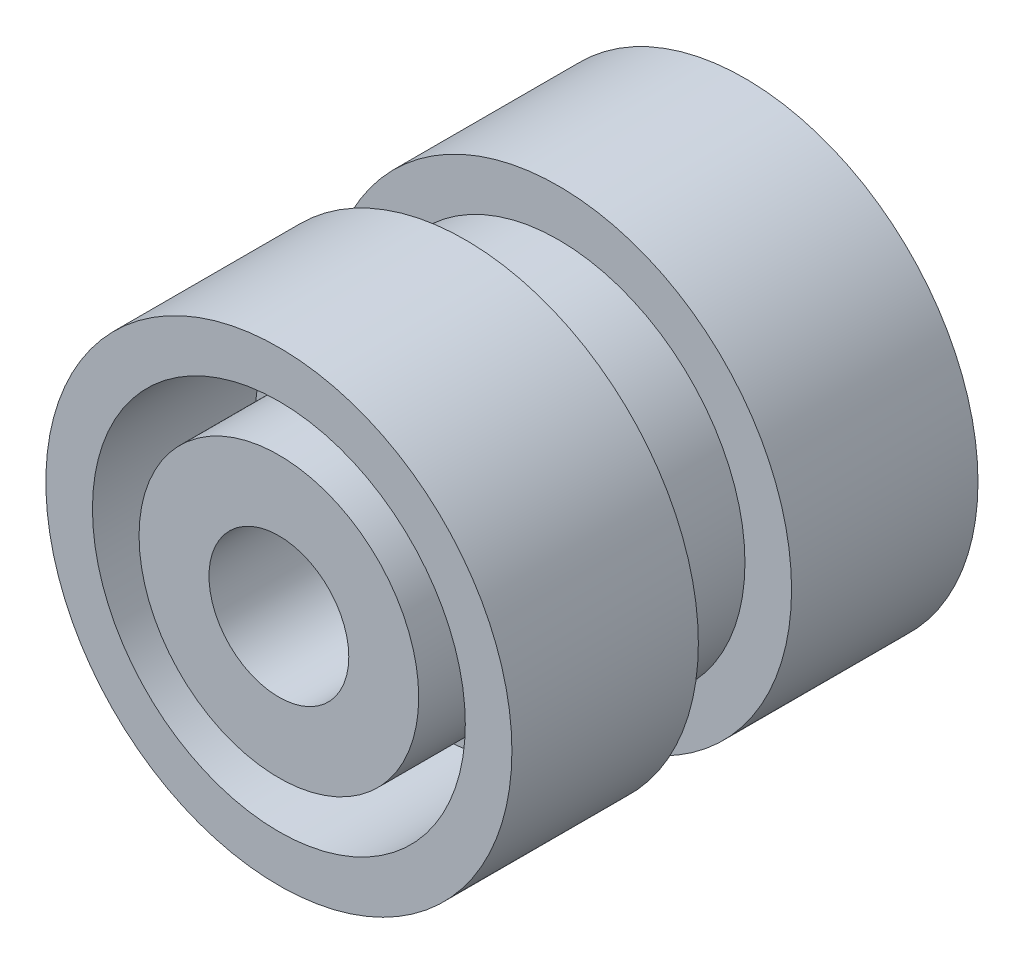
ISO-10303-21;
HEADER;
FILE_DESCRIPTION(('STEP AP214'),'2;1');
FILE_NAME('part.step','',(''),(''),'','','');
FILE_SCHEMA(('AUTOMOTIVE_DESIGN { 1 0 10303 214 1 1 1 1 }'));
ENDSEC;
DATA;
#1=APPLICATION_CONTEXT('core data for automotive mechanical design processes');
#2=APPLICATION_PROTOCOL_DEFINITION('international standard','automotive_design',2000,#1);
#3=PRODUCT_CONTEXT('',#1,'mechanical');
#4=PRODUCT('Part','Part','',(#3));
#5=PRODUCT_RELATED_PRODUCT_CATEGORY('part','',(#4));
#6=PRODUCT_DEFINITION_FORMATION('','',#4);
#7=PRODUCT_DEFINITION_CONTEXT('part definition',#1,'design');
#8=PRODUCT_DEFINITION('design','',#6,#7);
#9=PRODUCT_DEFINITION_SHAPE('','',#8);
#10=(LENGTH_UNIT() NAMED_UNIT(*) SI_UNIT(.MILLI.,.METRE.));
#11=(NAMED_UNIT(*) PLANE_ANGLE_UNIT() SI_UNIT($,.RADIAN.));
#12=(NAMED_UNIT(*) SI_UNIT($,.STERADIAN.) SOLID_ANGLE_UNIT());
#13=UNCERTAINTY_MEASURE_WITH_UNIT(LENGTH_MEASURE(1.E-05),#10,'distance_accuracy_value','');
#14=(GEOMETRIC_REPRESENTATION_CONTEXT(3) GLOBAL_UNCERTAINTY_ASSIGNED_CONTEXT((#13)) GLOBAL_UNIT_ASSIGNED_CONTEXT((#10,
#11,#12)) REPRESENTATION_CONTEXT('',''));
#15=CARTESIAN_POINT('',(0.,0.,0.));
#16=DIRECTION('',(0.,0.,1.));
#17=DIRECTION('',(1.,0.,0.));
#18=AXIS2_PLACEMENT_3D('',#15,#16,#17);
#19=CARTESIAN_POINT('',(0.,0.,7.45105840458972));
#20=DIRECTION('',(0.,0.,1.));
#21=DIRECTION('',(1.,0.,0.));
#22=AXIS2_PLACEMENT_3D('',#19,#20,#21);
#23=CYLINDRICAL_SURFACE('',#22,4.);
#24=CARTESIAN_POINT('',(0.,0.,-5.));
#25=DIRECTION('',(0.,0.,1.));
#26=DIRECTION('',(1.,0.,0.));
#27=AXIS2_PLACEMENT_3D('',#24,#25,#26);
#28=CIRCLE('',#27,4.);
#29=CARTESIAN_POINT('',(4.,0.,-5.));
#30=VERTEX_POINT('',#29);
#31=EDGE_CURVE('E333',#30,#30,#28,.T.);
#32=ORIENTED_EDGE('',*,*,#31,.F.);
#33=EDGE_LOOP('',(#32));
#34=FACE_BOUND('',#33,.T.);
#35=DIRECTION('',(0.,0.,1.));
#36=VECTOR('',#35,1.);
#37=CARTESIAN_POINT('',(0.500000000000047,-3.96862696659688,-3.5));
#38=LINE('',#37,#36);
#39=CARTESIAN_POINT('',(0.500000000000047,-3.96862696659688,-3.5));
#40=VERTEX_POINT('',#39);
#41=CARTESIAN_POINT('',(0.500000000000047,-3.96862696659688,-1.5));
#42=VERTEX_POINT('',#41);
#43=EDGE_CURVE('E309',#40,#42,#38,.T.);
#44=ORIENTED_EDGE('',*,*,#43,.T.);
#45=CARTESIAN_POINT('',(0.,0.,-1.5));
#46=DIRECTION('',(0.,0.,1.));
#47=DIRECTION('',(1.,0.,0.));
#48=AXIS2_PLACEMENT_3D('',#45,#46,#47);
#49=CIRCLE('',#48,4.);
#50=CARTESIAN_POINT('',(3.96862696659689,-0.499999999999959,-1.5));
#51=VERTEX_POINT('',#50);
#52=EDGE_CURVE('E173',#42,#51,#49,.T.);
#53=ORIENTED_EDGE('',*,*,#52,.T.);
#54=DIRECTION('',(0.,0.,1.));
#55=VECTOR('',#54,1.);
#56=CARTESIAN_POINT('',(3.96862696659689,-0.499999999999958,-3.5));
#57=LINE('',#56,#55);
#58=CARTESIAN_POINT('',(3.96862696659689,-0.499999999999958,-3.5));
#59=VERTEX_POINT('',#58);
#60=EDGE_CURVE('E320',#59,#51,#57,.T.);
#61=ORIENTED_EDGE('',*,*,#60,.F.);
#62=CARTESIAN_POINT('',(0.,0.,-3.5));
#63=DIRECTION('',(0.,0.,-1.));
#64=DIRECTION('',(-1.,0.,0.));
#65=AXIS2_PLACEMENT_3D('',#62,#63,#64);
#66=CIRCLE('',#65,4.);
#67=CARTESIAN_POINT('',(3.96862696659688,0.500000000000042,-3.5));
#68=VERTEX_POINT('',#67);
#69=EDGE_CURVE('E203',#68,#59,#66,.T.);
#70=ORIENTED_EDGE('',*,*,#69,.F.);
#71=DIRECTION('',(0.,0.,1.));
#72=VECTOR('',#71,1.);
#73=CARTESIAN_POINT('',(3.96862696659688,0.500000000000042,-3.5));
#74=LINE('',#73,#72);
#75=CARTESIAN_POINT('',(3.96862696659688,0.500000000000042,-1.5));
#76=VERTEX_POINT('',#75);
#77=EDGE_CURVE('E324',#68,#76,#74,.T.);
#78=ORIENTED_EDGE('',*,*,#77,.T.);
#79=CARTESIAN_POINT('',(0.5,3.96862696659689,-1.5));
#80=VERTEX_POINT('',#79);
#81=EDGE_CURVE('E329',#76,#80,#49,.T.);
#82=ORIENTED_EDGE('',*,*,#81,.T.);
#83=DIRECTION('',(0.,0.,1.));
#84=VECTOR('',#83,1.);
#85=CARTESIAN_POINT('',(0.5,3.96862696659689,-3.5));
#86=LINE('',#85,#84);
#87=CARTESIAN_POINT('',(0.5,3.96862696659689,-3.5));
#88=VERTEX_POINT('',#87);
#89=EDGE_CURVE('E277',#88,#80,#86,.T.);
#90=ORIENTED_EDGE('',*,*,#89,.F.);
#91=CARTESIAN_POINT('',(-0.5,3.96862696659689,-3.5));
#92=VERTEX_POINT('',#91);
#93=EDGE_CURVE('E189',#92,#88,#66,.T.);
#94=ORIENTED_EDGE('',*,*,#93,.F.);
#95=DIRECTION('',(0.,0.,1.));
#96=VECTOR('',#95,1.);
#97=CARTESIAN_POINT('',(-0.5,3.96862696659689,-3.5));
#98=LINE('',#97,#96);
#99=CARTESIAN_POINT('',(-0.5,3.96862696659689,-1.5));
#100=VERTEX_POINT('',#99);
#101=EDGE_CURVE('E280',#92,#100,#98,.T.);
#102=ORIENTED_EDGE('',*,*,#101,.T.);
#103=CARTESIAN_POINT('',(-3.96862696659689,0.499999999999986,-1.5));
#104=VERTEX_POINT('',#103);
#105=EDGE_CURVE('E334',#100,#104,#49,.T.);
#106=ORIENTED_EDGE('',*,*,#105,.T.);
#107=DIRECTION('',(0.,0.,1.));
#108=VECTOR('',#107,1.);
#109=CARTESIAN_POINT('',(-3.96862696659689,0.499999999999987,-3.5));
#110=LINE('',#109,#108);
#111=CARTESIAN_POINT('',(-3.96862696659689,0.499999999999987,-3.5));
#112=VERTEX_POINT('',#111);
#113=EDGE_CURVE('E292',#112,#104,#110,.T.);
#114=ORIENTED_EDGE('',*,*,#113,.F.);
#115=CARTESIAN_POINT('',(-3.96862696659688,-0.500000000000013,-3.5));
#116=VERTEX_POINT('',#115);
#117=EDGE_CURVE('E228',#116,#112,#66,.T.);
#118=ORIENTED_EDGE('',*,*,#117,.F.);
#119=DIRECTION('',(0.,0.,1.));
#120=VECTOR('',#119,1.);
#121=CARTESIAN_POINT('',(-3.96862696659688,-0.500000000000013,-3.5));
#122=LINE('',#121,#120);
#123=CARTESIAN_POINT('',(-3.96862696659688,-0.500000000000013,-1.5));
#124=VERTEX_POINT('',#123);
#125=EDGE_CURVE('E296',#116,#124,#122,.T.);
#126=ORIENTED_EDGE('',*,*,#125,.T.);
#127=CARTESIAN_POINT('',(-0.499999999999953,-3.96862696659689,-1.5));
#128=VERTEX_POINT('',#127);
#129=EDGE_CURVE('E442',#124,#128,#49,.T.);
#130=ORIENTED_EDGE('',*,*,#129,.T.);
#131=DIRECTION('',(0.,0.,1.));
#132=VECTOR('',#131,1.);
#133=CARTESIAN_POINT('',(-0.499999999999953,-3.96862696659689,-3.5));
#134=LINE('',#133,#132);
#135=CARTESIAN_POINT('',(-0.499999999999953,-3.96862696659689,-3.5));
#136=VERTEX_POINT('',#135);
#137=EDGE_CURVE('E70',#136,#128,#134,.T.);
#138=ORIENTED_EDGE('',*,*,#137,.F.);
#139=EDGE_CURVE('E65',#40,#136,#66,.T.);
#140=ORIENTED_EDGE('',*,*,#139,.F.);
#141=EDGE_LOOP('',(#44,#53,#61,#70,#78,#82,#90,#94,#102,#106,#114,#118,#126,#130,#138,#140));
#142=FACE_BOUND('',#141,.T.);
#143=ADVANCED_FACE('F49',(#34,#142),#23,.F.);
#144=CARTESIAN_POINT('',(0.,4.,-1.5));
#145=DIRECTION('',(0.,0.,1.));
#146=DIRECTION('',(1.,0.,0.));
#147=AXIS2_PLACEMENT_3D('',#144,#145,#146);
#148=PLANE('',#147);
#149=CARTESIAN_POINT('',(0.,0.,-1.5));
#150=DIRECTION('',(0.,0.,-1.));
#151=DIRECTION('',(-1.,0.,0.));
#152=AXIS2_PLACEMENT_3D('',#149,#150,#151);
#153=CIRCLE('',#152,2.);
#154=CARTESIAN_POINT('',(0.5,1.93649167310371,-1.5));
#155=VERTEX_POINT('',#154);
#156=CARTESIAN_POINT('',(1.9364916731037,0.50000000000002,-1.5));
#157=VERTEX_POINT('',#156);
#158=EDGE_CURVE('E241',#155,#157,#153,.T.);
#159=ORIENTED_EDGE('',*,*,#158,.F.);
#160=DIRECTION('',(0.,1.,0.));
#161=VECTOR('',#160,1.);
#162=CARTESIAN_POINT('',(0.5,0.,-1.5));
#163=LINE('',#162,#161);
#164=EDGE_CURVE('E169',#155,#80,#163,.T.);
#165=ORIENTED_EDGE('',*,*,#164,.T.);
#166=ORIENTED_EDGE('',*,*,#81,.F.);
#167=DIRECTION('',(1.,0.,0.));
#168=VECTOR('',#167,1.);
#169=CARTESIAN_POINT('',(0.,0.5,-1.5));
#170=LINE('',#169,#168);
#171=EDGE_CURVE('E245',#157,#76,#170,.T.);
#172=ORIENTED_EDGE('',*,*,#171,.F.);
#173=EDGE_LOOP('',(#159,#165,#166,#172));
#174=FACE_BOUND('',#173,.T.);
#175=ADVANCED_FACE('F431',(#174),#148,.F.);
#176=CARTESIAN_POINT('',(0.,0.,-1.5));
#177=DIRECTION('',(0.,0.,-1.));
#178=DIRECTION('',(-1.,0.,0.));
#179=AXIS2_PLACEMENT_3D('',#176,#177,#178);
#180=CIRCLE('',#179,2.);
#181=CARTESIAN_POINT('',(1.93649167310371,-0.49999999999998,-1.5));
#182=VERTEX_POINT('',#181);
#183=CARTESIAN_POINT('',(0.500000000000014,-1.9364916731037,-1.5));
#184=VERTEX_POINT('',#183);
#185=EDGE_CURVE('E252',#182,#184,#180,.T.);
#186=ORIENTED_EDGE('',*,*,#185,.F.);
#187=DIRECTION('',(1.,0.,0.));
#188=VECTOR('',#187,1.);
#189=CARTESIAN_POINT('',(0.,-0.5,-1.5));
#190=LINE('',#189,#188);
#191=EDGE_CURVE('E249',#182,#51,#190,.T.);
#192=ORIENTED_EDGE('',*,*,#191,.T.);
#193=ORIENTED_EDGE('',*,*,#52,.F.);
#194=DIRECTION('',(0.,-1.,0.));
#195=VECTOR('',#194,1.);
#196=CARTESIAN_POINT('',(0.499999999999982,0.,-1.5));
#197=LINE('',#196,#195);
#198=EDGE_CURVE('E256',#184,#42,#197,.T.);
#199=ORIENTED_EDGE('',*,*,#198,.F.);
#200=EDGE_LOOP('',(#186,#192,#193,#199));
#201=FACE_BOUND('',#200,.T.);
#202=ADVANCED_FACE('F439',(#201),#148,.F.);
#203=CARTESIAN_POINT('',(0.,0.,-1.5));
#204=DIRECTION('',(0.,0.,-1.));
#205=DIRECTION('',(-1.,0.,0.));
#206=AXIS2_PLACEMENT_3D('',#203,#204,#205);
#207=CIRCLE('',#206,2.);
#208=CARTESIAN_POINT('',(-0.499999999999986,-1.93649167310371,-1.5));
#209=VERTEX_POINT('',#208);
#210=CARTESIAN_POINT('',(-1.93649167310371,-0.500000000000006,-1.5));
#211=VERTEX_POINT('',#210);
#212=EDGE_CURVE('E263',#209,#211,#207,.T.);
#213=ORIENTED_EDGE('',*,*,#212,.F.);
#214=DIRECTION('',(0.,-1.,0.));
#215=VECTOR('',#214,1.);
#216=CARTESIAN_POINT('',(-0.500000000000018,0.,-1.5));
#217=LINE('',#216,#215);
#218=EDGE_CURVE('E260',#209,#128,#217,.T.);
#219=ORIENTED_EDGE('',*,*,#218,.T.);
#220=ORIENTED_EDGE('',*,*,#129,.F.);
#221=DIRECTION('',(-1.,0.,0.));
#222=VECTOR('',#221,1.);
#223=CARTESIAN_POINT('',(0.,-0.499999999999999,-1.5));
#224=LINE('',#223,#222);
#225=EDGE_CURVE('E267',#211,#124,#224,.T.);
#226=ORIENTED_EDGE('',*,*,#225,.F.);
#227=EDGE_LOOP('',(#213,#219,#220,#226));
#228=FACE_BOUND('',#227,.T.);
#229=ADVANCED_FACE('F461',(#228),#148,.F.);
#230=CARTESIAN_POINT('',(0.,0.,5.));
#231=DIRECTION('',(0.,0.,-1.));
#232=DIRECTION('',(-1.,0.,0.));
#233=AXIS2_PLACEMENT_3D('',#230,#231,#232);
#234=PLANE('',#233);
#235=CARTESIAN_POINT('',(0.,0.,5.));
#236=DIRECTION('',(0.,0.,1.));
#237=DIRECTION('',(1.,0.,0.));
#238=AXIS2_PLACEMENT_3D('',#235,#236,#237);
#239=CIRCLE('',#238,1.5);
#240=CARTESIAN_POINT('',(1.5,0.,5.));
#241=VERTEX_POINT('',#240);
#242=EDGE_CURVE('E198',#241,#241,#239,.T.);
#243=ORIENTED_EDGE('',*,*,#242,.F.);
#244=EDGE_LOOP('',(#243));
#245=FACE_BOUND('',#244,.T.);
#246=CARTESIAN_POINT('',(0.,0.,5.));
#247=DIRECTION('',(0.,0.,1.));
#248=DIRECTION('',(1.,0.,0.));
#249=AXIS2_PLACEMENT_3D('',#246,#247,#248);
#250=CIRCLE('',#249,3.);
#251=CARTESIAN_POINT('',(3.,0.,5.));
#252=VERTEX_POINT('',#251);
#253=EDGE_CURVE('E11',#252,#252,#250,.T.);
#254=ORIENTED_EDGE('',*,*,#253,.T.);
#255=EDGE_LOOP('',(#254));
#256=FACE_BOUND('',#255,.T.);
#257=ADVANCED_FACE('F51',(#245,#256),#234,.F.);
#258=CARTESIAN_POINT('',(0.,0.,7.45105840458972));
#259=DIRECTION('',(0.,0.,1.));
#260=DIRECTION('',(1.,0.,0.));
#261=AXIS2_PLACEMENT_3D('',#258,#259,#260);
#262=CYLINDRICAL_SURFACE('',#261,3.);
#263=ORIENTED_EDGE('',*,*,#253,.F.);
#264=EDGE_LOOP('',(#263));
#265=FACE_BOUND('',#264,.T.);
#266=CARTESIAN_POINT('',(0.,0.,1.5));
#267=DIRECTION('',(0.,0.,1.));
#268=DIRECTION('',(1.,0.,0.));
#269=AXIS2_PLACEMENT_3D('',#266,#267,#268);
#270=CIRCLE('',#269,3.);
#271=CARTESIAN_POINT('',(3.,0.,1.5));
#272=VERTEX_POINT('',#271);
#273=EDGE_CURVE('E58',#272,#272,#270,.T.);
#274=ORIENTED_EDGE('',*,*,#273,.T.);
#275=EDGE_LOOP('',(#274));
#276=FACE_BOUND('',#275,.T.);
#277=ADVANCED_FACE('F373',(#265,#276),#262,.T.);
#278=CARTESIAN_POINT('',(0.,3.,1.5));
#279=DIRECTION('',(0.,0.,-1.));
#280=DIRECTION('',(-1.,0.,0.));
#281=AXIS2_PLACEMENT_3D('',#278,#279,#280);
#282=PLANE('',#281);
#283=ORIENTED_EDGE('',*,*,#273,.F.);
#284=EDGE_LOOP('',(#283));
#285=FACE_BOUND('',#284,.T.);
#286=CARTESIAN_POINT('',(0.,0.,1.5));
#287=DIRECTION('',(0.,0.,1.));
#288=DIRECTION('',(1.,0.,0.));
#289=AXIS2_PLACEMENT_3D('',#286,#287,#288);
#290=CIRCLE('',#289,4.);
#291=CARTESIAN_POINT('',(4.,0.,1.5));
#292=VERTEX_POINT('',#291);
#293=EDGE_CURVE('E366',#292,#292,#290,.T.);
#294=ORIENTED_EDGE('',*,*,#293,.T.);
#295=EDGE_LOOP('',(#294));
#296=FACE_BOUND('',#295,.T.);
#297=ADVANCED_FACE('F375',(#285,#296),#282,.F.);
#298=CARTESIAN_POINT('',(0.,0.,7.45105840458972));
#299=DIRECTION('',(0.,0.,1.));
#300=DIRECTION('',(1.,0.,0.));
#301=AXIS2_PLACEMENT_3D('',#298,#299,#300);
#302=CYLINDRICAL_SURFACE('',#301,4.);
#303=ORIENTED_EDGE('',*,*,#293,.F.);
#304=EDGE_LOOP('',(#303));
#305=FACE_BOUND('',#304,.T.);
#306=CARTESIAN_POINT('',(0.,0.,5.));
#307=DIRECTION('',(0.,0.,1.));
#308=DIRECTION('',(1.,0.,0.));
#309=AXIS2_PLACEMENT_3D('',#306,#307,#308);
#310=CIRCLE('',#309,4.);
#311=CARTESIAN_POINT('',(4.,0.,5.));
#312=VERTEX_POINT('',#311);
#313=EDGE_CURVE('E362',#312,#312,#310,.T.);
#314=ORIENTED_EDGE('',*,*,#313,.T.);
#315=EDGE_LOOP('',(#314));
#316=FACE_BOUND('',#315,.T.);
#317=ADVANCED_FACE('F378',(#305,#316),#302,.F.);
#318=CARTESIAN_POINT('',(0.,4.,5.));
#319=DIRECTION('',(0.,0.,-1.));
#320=DIRECTION('',(-1.,0.,0.));
#321=AXIS2_PLACEMENT_3D('',#318,#319,#320);
#322=PLANE('',#321);
#323=ORIENTED_EDGE('',*,*,#313,.F.);
#324=EDGE_LOOP('',(#323));
#325=FACE_BOUND('',#324,.T.);
#326=CARTESIAN_POINT('',(0.,0.,5.));
#327=DIRECTION('',(0.,0.,1.));
#328=DIRECTION('',(1.,0.,0.));
#329=AXIS2_PLACEMENT_3D('',#326,#327,#328);
#330=CIRCLE('',#329,5.);
#331=CARTESIAN_POINT('',(5.,0.,5.));
#332=VERTEX_POINT('',#331);
#333=EDGE_CURVE('E358',#332,#332,#330,.T.);
#334=ORIENTED_EDGE('',*,*,#333,.T.);
#335=EDGE_LOOP('',(#334));
#336=FACE_BOUND('',#335,.T.);
#337=ADVANCED_FACE('F384',(#325,#336),#322,.F.);
#338=CARTESIAN_POINT('',(0.,0.,7.45105840458972));
#339=DIRECTION('',(0.,0.,1.));
#340=DIRECTION('',(1.,0.,0.));
#341=AXIS2_PLACEMENT_3D('',#338,#339,#340);
#342=CYLINDRICAL_SURFACE('',#341,5.);
#343=ORIENTED_EDGE('',*,*,#333,.F.);
#344=EDGE_LOOP('',(#343));
#345=FACE_BOUND('',#344,.T.);
#346=CARTESIAN_POINT('',(0.,0.,1.));
#347=DIRECTION('',(0.,0.,1.));
#348=DIRECTION('',(1.,0.,0.));
#349=AXIS2_PLACEMENT_3D('',#346,#347,#348);
#350=CIRCLE('',#349,5.);
#351=CARTESIAN_POINT('',(5.,0.,1.));
#352=VERTEX_POINT('',#351);
#353=EDGE_CURVE('E354',#352,#352,#350,.T.);
#354=ORIENTED_EDGE('',*,*,#353,.T.);
#355=EDGE_LOOP('',(#354));
#356=FACE_BOUND('',#355,.T.);
#357=ADVANCED_FACE('F390',(#345,#356),#342,.T.);
#358=CARTESIAN_POINT('',(0.,5.,1.));
#359=DIRECTION('',(0.,0.,1.));
#360=DIRECTION('',(1.,0.,0.));
#361=AXIS2_PLACEMENT_3D('',#358,#359,#360);
#362=PLANE('',#361);
#363=ORIENTED_EDGE('',*,*,#353,.F.);
#364=EDGE_LOOP('',(#363));
#365=FACE_BOUND('',#364,.T.);
#366=CARTESIAN_POINT('',(0.,0.,1.));
#367=DIRECTION('',(0.,0.,1.));
#368=DIRECTION('',(1.,0.,0.));
#369=AXIS2_PLACEMENT_3D('',#366,#367,#368);
#370=CIRCLE('',#369,4.);
#371=CARTESIAN_POINT('',(4.,0.,1.));
#372=VERTEX_POINT('',#371);
#373=EDGE_CURVE('E350',#372,#372,#370,.T.);
#374=ORIENTED_EDGE('',*,*,#373,.T.);
#375=EDGE_LOOP('',(#374));
#376=FACE_BOUND('',#375,.T.);
#377=ADVANCED_FACE('F396',(#365,#376),#362,.F.);
#378=CARTESIAN_POINT('',(0.,0.,7.45105840458972));
#379=DIRECTION('',(0.,0.,1.));
#380=DIRECTION('',(1.,0.,0.));
#381=AXIS2_PLACEMENT_3D('',#378,#379,#380);
#382=CYLINDRICAL_SURFACE('',#381,4.);
#383=ORIENTED_EDGE('',*,*,#373,.F.);
#384=EDGE_LOOP('',(#383));
#385=FACE_BOUND('',#384,.T.);
#386=CARTESIAN_POINT('',(0.,0.,-1.));
#387=DIRECTION('',(0.,0.,1.));
#388=DIRECTION('',(1.,0.,0.));
#389=AXIS2_PLACEMENT_3D('',#386,#387,#388);
#390=CIRCLE('',#389,4.);
#391=CARTESIAN_POINT('',(4.,0.,-1.));
#392=VERTEX_POINT('',#391);
#393=EDGE_CURVE('E346',#392,#392,#390,.T.);
#394=ORIENTED_EDGE('',*,*,#393,.T.);
#395=EDGE_LOOP('',(#394));
#396=FACE_BOUND('',#395,.T.);
#397=ADVANCED_FACE('F402',(#385,#396),#382,.T.);
#398=CARTESIAN_POINT('',(0.,5.,-1.));
#399=DIRECTION('',(0.,0.,-1.));
#400=DIRECTION('',(-1.,0.,0.));
#401=AXIS2_PLACEMENT_3D('',#398,#399,#400);
#402=PLANE('',#401);
#403=ORIENTED_EDGE('',*,*,#393,.F.);
#404=EDGE_LOOP('',(#403));
#405=FACE_BOUND('',#404,.T.);
#406=CARTESIAN_POINT('',(0.,0.,-1.));
#407=DIRECTION('',(0.,0.,1.));
#408=DIRECTION('',(1.,0.,0.));
#409=AXIS2_PLACEMENT_3D('',#406,#407,#408);
#410=CIRCLE('',#409,5.);
#411=CARTESIAN_POINT('',(5.,0.,-1.));
#412=VERTEX_POINT('',#411);
#413=EDGE_CURVE('E342',#412,#412,#410,.T.);
#414=ORIENTED_EDGE('',*,*,#413,.T.);
#415=EDGE_LOOP('',(#414));
#416=FACE_BOUND('',#415,.T.);
#417=ADVANCED_FACE('F408',(#405,#416),#402,.F.);
#418=CARTESIAN_POINT('',(0.,0.,7.45105840458972));
#419=DIRECTION('',(0.,0.,1.));
#420=DIRECTION('',(1.,0.,0.));
#421=AXIS2_PLACEMENT_3D('',#418,#419,#420);
#422=CYLINDRICAL_SURFACE('',#421,5.);
#423=ORIENTED_EDGE('',*,*,#413,.F.);
#424=EDGE_LOOP('',(#423));
#425=FACE_BOUND('',#424,.T.);
#426=CARTESIAN_POINT('',(0.,0.,-5.));
#427=DIRECTION('',(0.,0.,1.));
#428=DIRECTION('',(1.,0.,0.));
#429=AXIS2_PLACEMENT_3D('',#426,#427,#428);
#430=CIRCLE('',#429,5.);
#431=CARTESIAN_POINT('',(5.,0.,-5.));
#432=VERTEX_POINT('',#431);
#433=EDGE_CURVE('E338',#432,#432,#430,.T.);
#434=ORIENTED_EDGE('',*,*,#433,.T.);
#435=EDGE_LOOP('',(#434));
#436=FACE_BOUND('',#435,.T.);
#437=ADVANCED_FACE('F414',(#425,#436),#422,.T.);
#438=CARTESIAN_POINT('',(0.,4.,-5.));
#439=DIRECTION('',(0.,0.,1.));
#440=DIRECTION('',(1.,0.,0.));
#441=AXIS2_PLACEMENT_3D('',#438,#439,#440);
#442=PLANE('',#441);
#443=ORIENTED_EDGE('',*,*,#433,.F.);
#444=EDGE_LOOP('',(#443));
#445=FACE_BOUND('',#444,.T.);
#446=ORIENTED_EDGE('',*,*,#31,.T.);
#447=EDGE_LOOP('',(#446));
#448=FACE_BOUND('',#447,.T.);
#449=ADVANCED_FACE('F420',(#445,#448),#442,.F.);
#450=CARTESIAN_POINT('',(0.,0.,-1.5));
#451=DIRECTION('',(0.,0.,-1.));
#452=DIRECTION('',(-1.,0.,0.));
#453=AXIS2_PLACEMENT_3D('',#450,#451,#452);
#454=CIRCLE('',#453,2.);
#455=CARTESIAN_POINT('',(-1.93649167310371,0.499999999999994,-1.5));
#456=VERTEX_POINT('',#455);
#457=CARTESIAN_POINT('',(-0.5,1.93649167310371,-1.5));
#458=VERTEX_POINT('',#457);
#459=EDGE_CURVE('E195',#456,#458,#454,.T.);
#460=ORIENTED_EDGE('',*,*,#459,.F.);
#461=DIRECTION('',(-1.,0.,0.));
#462=VECTOR('',#461,1.);
#463=CARTESIAN_POINT('',(0.,0.500000000000001,-1.5));
#464=LINE('',#463,#462);
#465=EDGE_CURVE('E271',#456,#104,#464,.T.);
#466=ORIENTED_EDGE('',*,*,#465,.T.);
#467=ORIENTED_EDGE('',*,*,#105,.F.);
#468=DIRECTION('',(0.,1.,0.));
#469=VECTOR('',#468,1.);
#470=CARTESIAN_POINT('',(-0.5,0.,-1.5));
#471=LINE('',#470,#469);
#472=EDGE_CURVE('E191',#458,#100,#471,.T.);
#473=ORIENTED_EDGE('',*,*,#472,.F.);
#474=EDGE_LOOP('',(#460,#466,#467,#473));
#475=FACE_BOUND('',#474,.T.);
#476=ADVANCED_FACE('F426',(#475),#148,.F.);
#477=CARTESIAN_POINT('',(0.5,0.,-3.5));
#478=DIRECTION('',(1.,0.,0.));
#479=DIRECTION('',(0.,0.,-1.));
#480=AXIS2_PLACEMENT_3D('',#477,#478,#479);
#481=PLANE('',#480);
#482=ORIENTED_EDGE('',*,*,#164,.F.);
#483=DIRECTION('',(0.,0.,1.));
#484=VECTOR('',#483,1.);
#485=CARTESIAN_POINT('',(0.5,1.93649167310371,-3.5));
#486=LINE('',#485,#484);
#487=CARTESIAN_POINT('',(0.5,1.93649167310371,-3.5));
#488=VERTEX_POINT('',#487);
#489=EDGE_CURVE('E163',#488,#155,#486,.T.);
#490=ORIENTED_EDGE('',*,*,#489,.F.);
#491=DIRECTION('',(0.,1.,0.));
#492=VECTOR('',#491,1.);
#493=CARTESIAN_POINT('',(0.5,0.,-3.5));
#494=LINE('',#493,#492);
#495=EDGE_CURVE('E168',#488,#88,#494,.T.);
#496=ORIENTED_EDGE('',*,*,#495,.T.);
#497=ORIENTED_EDGE('',*,*,#89,.T.);
#498=EDGE_LOOP('',(#482,#490,#496,#497));
#499=FACE_BOUND('',#498,.T.);
#500=ADVANCED_FACE('F165',(#499),#481,.T.);
#501=CARTESIAN_POINT('',(0.,0.,-3.5));
#502=DIRECTION('',(0.,0.,1.));
#503=DIRECTION('',(1.,0.,0.));
#504=AXIS2_PLACEMENT_3D('',#501,#502,#503);
#505=CYLINDRICAL_SURFACE('',#504,2.);
#506=ORIENTED_EDGE('',*,*,#158,.T.);
#507=DIRECTION('',(0.,0.,1.));
#508=VECTOR('',#507,1.);
#509=CARTESIAN_POINT('',(1.9364916731037,0.50000000000002,-3.5));
#510=LINE('',#509,#508);
#511=CARTESIAN_POINT('',(1.9364916731037,0.50000000000002,-3.5));
#512=VERTEX_POINT('',#511);
#513=EDGE_CURVE('E174',#512,#157,#510,.T.);
#514=ORIENTED_EDGE('',*,*,#513,.F.);
#515=CARTESIAN_POINT('',(0.,0.,-3.5));
#516=DIRECTION('',(0.,0.,-1.));
#517=DIRECTION('',(-1.,0.,0.));
#518=AXIS2_PLACEMENT_3D('',#515,#516,#517);
#519=CIRCLE('',#518,2.);
#520=EDGE_CURVE('E177',#488,#512,#519,.T.);
#521=ORIENTED_EDGE('',*,*,#520,.F.);
#522=ORIENTED_EDGE('',*,*,#489,.T.);
#523=EDGE_LOOP('',(#506,#514,#521,#522));
#524=FACE_BOUND('',#523,.T.);
#525=ADVANCED_FACE('F178',(#524),#505,.T.);
#526=CARTESIAN_POINT('',(0.,0.5,-3.5));
#527=DIRECTION('',(0.,-1.,0.));
#528=DIRECTION('',(1.,0.,0.));
#529=AXIS2_PLACEMENT_3D('',#526,#527,#528);
#530=PLANE('',#529);
#531=ORIENTED_EDGE('',*,*,#171,.T.);
#532=ORIENTED_EDGE('',*,*,#77,.F.);
#533=DIRECTION('',(1.,0.,0.));
#534=VECTOR('',#533,1.);
#535=CARTESIAN_POINT('',(0.,0.5,-3.5));
#536=LINE('',#535,#534);
#537=EDGE_CURVE('E184',#512,#68,#536,.T.);
#538=ORIENTED_EDGE('',*,*,#537,.F.);
#539=ORIENTED_EDGE('',*,*,#513,.T.);
#540=EDGE_LOOP('',(#531,#532,#538,#539));
#541=FACE_BOUND('',#540,.T.);
#542=ADVANCED_FACE('F453',(#541),#530,.F.);
#543=CARTESIAN_POINT('',(0.,-0.5,-3.5));
#544=DIRECTION('',(0.,-1.,0.));
#545=DIRECTION('',(1.,0.,0.));
#546=AXIS2_PLACEMENT_3D('',#543,#544,#545);
#547=PLANE('',#546);
#548=ORIENTED_EDGE('',*,*,#191,.F.);
#549=DIRECTION('',(0.,0.,1.));
#550=VECTOR('',#549,1.);
#551=CARTESIAN_POINT('',(1.93649167310371,-0.49999999999998,-3.5));
#552=LINE('',#551,#550);
#553=CARTESIAN_POINT('',(1.93649167310371,-0.49999999999998,-3.5));
#554=VERTEX_POINT('',#553);
#555=EDGE_CURVE('E316',#554,#182,#552,.T.);
#556=ORIENTED_EDGE('',*,*,#555,.F.);
#557=DIRECTION('',(1.,0.,0.));
#558=VECTOR('',#557,1.);
#559=CARTESIAN_POINT('',(0.,-0.5,-3.5));
#560=LINE('',#559,#558);
#561=EDGE_CURVE('E207',#554,#59,#560,.T.);
#562=ORIENTED_EDGE('',*,*,#561,.T.);
#563=ORIENTED_EDGE('',*,*,#60,.T.);
#564=EDGE_LOOP('',(#548,#556,#562,#563));
#565=FACE_BOUND('',#564,.T.);
#566=ADVANCED_FACE('F450',(#565),#547,.T.);
#567=CARTESIAN_POINT('',(0.,0.,-3.5));
#568=DIRECTION('',(0.,0.,1.));
#569=DIRECTION('',(1.,0.,0.));
#570=AXIS2_PLACEMENT_3D('',#567,#568,#569);
#571=CYLINDRICAL_SURFACE('',#570,2.);
#572=ORIENTED_EDGE('',*,*,#185,.T.);
#573=DIRECTION('',(0.,0.,1.));
#574=VECTOR('',#573,1.);
#575=CARTESIAN_POINT('',(0.500000000000014,-1.9364916731037,-3.5));
#576=LINE('',#575,#574);
#577=CARTESIAN_POINT('',(0.500000000000014,-1.9364916731037,-3.5));
#578=VERTEX_POINT('',#577);
#579=EDGE_CURVE('E312',#578,#184,#576,.T.);
#580=ORIENTED_EDGE('',*,*,#579,.F.);
#581=CARTESIAN_POINT('',(0.,0.,-3.5));
#582=DIRECTION('',(0.,0.,-1.));
#583=DIRECTION('',(-1.,0.,0.));
#584=AXIS2_PLACEMENT_3D('',#581,#582,#583);
#585=CIRCLE('',#584,2.);
#586=EDGE_CURVE('E211',#554,#578,#585,.T.);
#587=ORIENTED_EDGE('',*,*,#586,.F.);
#588=ORIENTED_EDGE('',*,*,#555,.T.);
#589=EDGE_LOOP('',(#572,#580,#587,#588));
#590=FACE_BOUND('',#589,.T.);
#591=ADVANCED_FACE('F447',(#590),#571,.T.);
#592=CARTESIAN_POINT('',(0.499999999999982,0.,-3.5));
#593=DIRECTION('',(-1.,0.,0.));
#594=DIRECTION('',(0.,-1.,0.));
#595=AXIS2_PLACEMENT_3D('',#592,#593,#594);
#596=PLANE('',#595);
#597=ORIENTED_EDGE('',*,*,#198,.T.);
#598=ORIENTED_EDGE('',*,*,#43,.F.);
#599=DIRECTION('',(0.,-1.,0.));
#600=VECTOR('',#599,1.);
#601=CARTESIAN_POINT('',(0.499999999999982,0.,-3.5));
#602=LINE('',#601,#600);
#603=EDGE_CURVE('E214',#578,#40,#602,.T.);
#604=ORIENTED_EDGE('',*,*,#603,.F.);
#605=ORIENTED_EDGE('',*,*,#579,.T.);
#606=EDGE_LOOP('',(#597,#598,#604,#605));
#607=FACE_BOUND('',#606,.T.);
#608=ADVANCED_FACE('F443',(#607),#596,.F.);
#609=CARTESIAN_POINT('',(-0.500000000000018,0.,-3.5));
#610=DIRECTION('',(-1.,0.,0.));
#611=DIRECTION('',(0.,-1.,0.));
#612=AXIS2_PLACEMENT_3D('',#609,#610,#611);
#613=PLANE('',#612);
#614=ORIENTED_EDGE('',*,*,#218,.F.);
#615=DIRECTION('',(0.,0.,1.));
#616=VECTOR('',#615,1.);
#617=CARTESIAN_POINT('',(-0.499999999999986,-1.93649167310371,-3.5));
#618=LINE('',#617,#616);
#619=CARTESIAN_POINT('',(-0.499999999999986,-1.93649167310371,-3.5));
#620=VERTEX_POINT('',#619);
#621=EDGE_CURVE('E303',#620,#209,#618,.T.);
#622=ORIENTED_EDGE('',*,*,#621,.F.);
#623=DIRECTION('',(0.,-1.,0.));
#624=VECTOR('',#623,1.);
#625=CARTESIAN_POINT('',(-0.500000000000018,0.,-3.5));
#626=LINE('',#625,#624);
#627=EDGE_CURVE('E217',#620,#136,#626,.T.);
#628=ORIENTED_EDGE('',*,*,#627,.T.);
#629=ORIENTED_EDGE('',*,*,#137,.T.);
#630=EDGE_LOOP('',(#614,#622,#628,#629));
#631=FACE_BOUND('',#630,.T.);
#632=ADVANCED_FACE('F482',(#631),#613,.T.);
#633=CARTESIAN_POINT('',(0.,0.,-3.5));
#634=DIRECTION('',(0.,0.,1.));
#635=DIRECTION('',(1.,0.,0.));
#636=AXIS2_PLACEMENT_3D('',#633,#634,#635);
#637=CYLINDRICAL_SURFACE('',#636,2.);
#638=ORIENTED_EDGE('',*,*,#212,.T.);
#639=DIRECTION('',(0.,0.,1.));
#640=VECTOR('',#639,1.);
#641=CARTESIAN_POINT('',(-1.93649167310371,-0.500000000000006,-3.5));
#642=LINE('',#641,#640);
#643=CARTESIAN_POINT('',(-1.93649167310371,-0.500000000000006,-3.5));
#644=VERTEX_POINT('',#643);
#645=EDGE_CURVE('E299',#644,#211,#642,.T.);
#646=ORIENTED_EDGE('',*,*,#645,.F.);
#647=CARTESIAN_POINT('',(0.,0.,-3.5));
#648=DIRECTION('',(0.,0.,-1.));
#649=DIRECTION('',(-1.,0.,0.));
#650=AXIS2_PLACEMENT_3D('',#647,#648,#649);
#651=CIRCLE('',#650,2.);
#652=EDGE_CURVE('E221',#620,#644,#651,.T.);
#653=ORIENTED_EDGE('',*,*,#652,.F.);
#654=ORIENTED_EDGE('',*,*,#621,.T.);
#655=EDGE_LOOP('',(#638,#646,#653,#654));
#656=FACE_BOUND('',#655,.T.);
#657=ADVANCED_FACE('F479',(#656),#637,.T.);
#658=CARTESIAN_POINT('',(0.,-0.499999999999999,-3.5));
#659=DIRECTION('',(0.,1.,0.));
#660=DIRECTION('',(-1.,0.,0.));
#661=AXIS2_PLACEMENT_3D('',#658,#659,#660);
#662=PLANE('',#661);
#663=ORIENTED_EDGE('',*,*,#225,.T.);
#664=ORIENTED_EDGE('',*,*,#125,.F.);
#665=DIRECTION('',(-1.,0.,0.));
#666=VECTOR('',#665,1.);
#667=CARTESIAN_POINT('',(0.,-0.499999999999999,-3.5));
#668=LINE('',#667,#666);
#669=EDGE_CURVE('E224',#644,#116,#668,.T.);
#670=ORIENTED_EDGE('',*,*,#669,.F.);
#671=ORIENTED_EDGE('',*,*,#645,.T.);
#672=EDGE_LOOP('',(#663,#664,#670,#671));
#673=FACE_BOUND('',#672,.T.);
#674=ADVANCED_FACE('F515',(#673),#662,.F.);
#675=CARTESIAN_POINT('',(0.,0.500000000000001,-3.5));
#676=DIRECTION('',(0.,1.,0.));
#677=DIRECTION('',(-1.,0.,0.));
#678=AXIS2_PLACEMENT_3D('',#675,#676,#677);
#679=PLANE('',#678);
#680=ORIENTED_EDGE('',*,*,#465,.F.);
#681=DIRECTION('',(0.,0.,1.));
#682=VECTOR('',#681,1.);
#683=CARTESIAN_POINT('',(-1.93649167310371,0.499999999999994,-3.5));
#684=LINE('',#683,#682);
#685=CARTESIAN_POINT('',(-1.93649167310371,0.499999999999994,-3.5));
#686=VERTEX_POINT('',#685);
#687=EDGE_CURVE('E288',#686,#456,#684,.T.);
#688=ORIENTED_EDGE('',*,*,#687,.F.);
#689=DIRECTION('',(-1.,0.,0.));
#690=VECTOR('',#689,1.);
#691=CARTESIAN_POINT('',(0.,0.500000000000001,-3.5));
#692=LINE('',#691,#690);
#693=EDGE_CURVE('E229',#686,#112,#692,.T.);
#694=ORIENTED_EDGE('',*,*,#693,.T.);
#695=ORIENTED_EDGE('',*,*,#113,.T.);
#696=EDGE_LOOP('',(#680,#688,#694,#695));
#697=FACE_BOUND('',#696,.T.);
#698=ADVANCED_FACE('F494',(#697),#679,.T.);
#699=CARTESIAN_POINT('',(0.,0.,-3.5));
#700=DIRECTION('',(0.,0.,1.));
#701=DIRECTION('',(1.,0.,0.));
#702=AXIS2_PLACEMENT_3D('',#699,#700,#701);
#703=CYLINDRICAL_SURFACE('',#702,2.);
#704=ORIENTED_EDGE('',*,*,#459,.T.);
#705=DIRECTION('',(0.,0.,1.));
#706=VECTOR('',#705,1.);
#707=CARTESIAN_POINT('',(-0.5,1.93649167310371,-3.5));
#708=LINE('',#707,#706);
#709=CARTESIAN_POINT('',(-0.5,1.93649167310371,-3.5));
#710=VERTEX_POINT('',#709);
#711=EDGE_CURVE('E284',#710,#458,#708,.T.);
#712=ORIENTED_EDGE('',*,*,#711,.F.);
#713=CARTESIAN_POINT('',(0.,0.,-3.5));
#714=DIRECTION('',(0.,0.,-1.));
#715=DIRECTION('',(-1.,0.,0.));
#716=AXIS2_PLACEMENT_3D('',#713,#714,#715);
#717=CIRCLE('',#716,2.);
#718=EDGE_CURVE('E233',#686,#710,#717,.T.);
#719=ORIENTED_EDGE('',*,*,#718,.F.);
#720=ORIENTED_EDGE('',*,*,#687,.T.);
#721=EDGE_LOOP('',(#704,#712,#719,#720));
#722=FACE_BOUND('',#721,.T.);
#723=ADVANCED_FACE('F499',(#722),#703,.T.);
#724=CARTESIAN_POINT('',(-0.5,0.,-3.5));
#725=DIRECTION('',(1.,0.,0.));
#726=DIRECTION('',(0.,0.,-1.));
#727=AXIS2_PLACEMENT_3D('',#724,#725,#726);
#728=PLANE('',#727);
#729=ORIENTED_EDGE('',*,*,#472,.T.);
#730=ORIENTED_EDGE('',*,*,#101,.F.);
#731=DIRECTION('',(0.,1.,0.));
#732=VECTOR('',#731,1.);
#733=CARTESIAN_POINT('',(-0.5,0.,-3.5));
#734=LINE('',#733,#732);
#735=EDGE_CURVE('E236',#710,#92,#734,.T.);
#736=ORIENTED_EDGE('',*,*,#735,.F.);
#737=ORIENTED_EDGE('',*,*,#711,.T.);
#738=EDGE_LOOP('',(#729,#730,#736,#737));
#739=FACE_BOUND('',#738,.T.);
#740=ADVANCED_FACE('F501',(#739),#728,.F.);
#741=CARTESIAN_POINT('',(0.,0.,-3.5));
#742=DIRECTION('',(0.,0.,-1.));
#743=DIRECTION('',(-1.,0.,0.));
#744=AXIS2_PLACEMENT_3D('',#741,#742,#743);
#745=PLANE('',#744);
#746=ORIENTED_EDGE('',*,*,#495,.F.);
#747=ORIENTED_EDGE('',*,*,#520,.T.);
#748=ORIENTED_EDGE('',*,*,#537,.T.);
#749=ORIENTED_EDGE('',*,*,#69,.T.);
#750=ORIENTED_EDGE('',*,*,#561,.F.);
#751=ORIENTED_EDGE('',*,*,#586,.T.);
#752=ORIENTED_EDGE('',*,*,#603,.T.);
#753=ORIENTED_EDGE('',*,*,#139,.T.);
#754=ORIENTED_EDGE('',*,*,#627,.F.);
#755=ORIENTED_EDGE('',*,*,#652,.T.);
#756=ORIENTED_EDGE('',*,*,#669,.T.);
#757=ORIENTED_EDGE('',*,*,#117,.T.);
#758=ORIENTED_EDGE('',*,*,#693,.F.);
#759=ORIENTED_EDGE('',*,*,#718,.T.);
#760=ORIENTED_EDGE('',*,*,#735,.T.);
#761=ORIENTED_EDGE('',*,*,#93,.T.);
#762=EDGE_LOOP('',(#746,#747,#748,#749,#750,#751,#752,#753,#754,#755,#756,#757,#758,#759,#760,#761));
#763=FACE_BOUND('',#762,.T.);
#764=ADVANCED_FACE('F187',(#763),#745,.T.);
#765=CARTESIAN_POINT('',(0.,0.,-3.));
#766=DIRECTION('',(0.,0.,1.));
#767=DIRECTION('',(1.,0.,0.));
#768=AXIS2_PLACEMENT_3D('',#765,#766,#767);
#769=CYLINDRICAL_SURFACE('',#768,1.5);
#770=CARTESIAN_POINT('',(0.,0.,-3.));
#771=DIRECTION('',(0.,0.,1.));
#772=DIRECTION('',(1.,0.,0.));
#773=AXIS2_PLACEMENT_3D('',#770,#771,#772);
#774=CIRCLE('',#773,1.5);
#775=CARTESIAN_POINT('',(1.5,0.,-3.));
#776=VERTEX_POINT('',#775);
#777=EDGE_CURVE('E242',#776,#776,#774,.T.);
#778=ORIENTED_EDGE('',*,*,#777,.F.);
#779=EDGE_LOOP('',(#778));
#780=FACE_BOUND('',#779,.T.);
#781=ORIENTED_EDGE('',*,*,#242,.T.);
#782=EDGE_LOOP('',(#781));
#783=FACE_BOUND('',#782,.T.);
#784=ADVANCED_FACE('F508',(#780,#783),#769,.F.);
#785=CARTESIAN_POINT('',(0.,0.,-3.));
#786=DIRECTION('',(0.,0.,1.));
#787=DIRECTION('',(1.,0.,0.));
#788=AXIS2_PLACEMENT_3D('',#785,#786,#787);
#789=PLANE('',#788);
#790=ORIENTED_EDGE('',*,*,#777,.T.);
#791=EDGE_LOOP('',(#790));
#792=FACE_BOUND('',#791,.T.);
#793=ADVANCED_FACE('F603',(#792),#789,.T.);
#794=CLOSED_SHELL('',(#143,#175,#202,#229,#257,#277,#297,#317,#337,#357,#377,#397,#417,#437,
#449,#476,#500,#525,#542,#566,#591,#608,#632,#657,#674,#698,#723,#740,#764,#784,#793));
#795=MANIFOLD_SOLID_BREP('B2',#794);
#796=ADVANCED_BREP_SHAPE_REPRESENTATION('',(#18,#795),#14);
#797=SHAPE_DEFINITION_REPRESENTATION(#9,#796);
ENDSEC;
END-ISO-10303-21;
